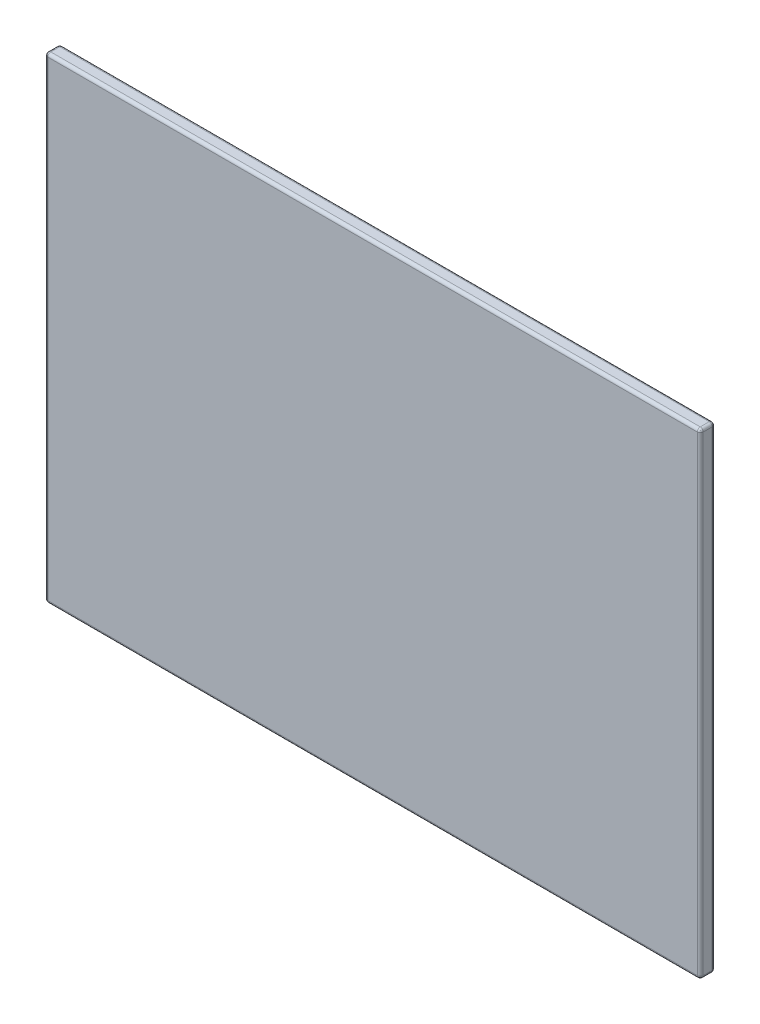
ISO-10303-21;
HEADER;
FILE_DESCRIPTION(('STEP AP214'),'2;1');
FILE_NAME('part.step','',(''),(''),'','','');
FILE_SCHEMA(('AUTOMOTIVE_DESIGN { 1 0 10303 214 1 1 1 1 }'));
ENDSEC;
DATA;
#1=APPLICATION_CONTEXT('core data for automotive mechanical design processes');
#2=APPLICATION_PROTOCOL_DEFINITION('international standard','automotive_design',2000,#1);
#3=PRODUCT_CONTEXT('',#1,'mechanical');
#4=PRODUCT('Part','Part','',(#3));
#5=PRODUCT_RELATED_PRODUCT_CATEGORY('part','',(#4));
#6=PRODUCT_DEFINITION_FORMATION('','',#4);
#7=PRODUCT_DEFINITION_CONTEXT('part definition',#1,'design');
#8=PRODUCT_DEFINITION('design','',#6,#7);
#9=PRODUCT_DEFINITION_SHAPE('','',#8);
#10=(LENGTH_UNIT() NAMED_UNIT(*) SI_UNIT(.MILLI.,.METRE.));
#11=(NAMED_UNIT(*) PLANE_ANGLE_UNIT() SI_UNIT($,.RADIAN.));
#12=(NAMED_UNIT(*) SI_UNIT($,.STERADIAN.) SOLID_ANGLE_UNIT());
#13=UNCERTAINTY_MEASURE_WITH_UNIT(LENGTH_MEASURE(1.E-05),#10,'distance_accuracy_value','');
#14=(GEOMETRIC_REPRESENTATION_CONTEXT(3) GLOBAL_UNCERTAINTY_ASSIGNED_CONTEXT((#13)) GLOBAL_UNIT_ASSIGNED_CONTEXT((#10,
#11,#12)) REPRESENTATION_CONTEXT('',''));
#15=CARTESIAN_POINT('',(0.,0.,0.));
#16=DIRECTION('',(0.,0.,1.));
#17=DIRECTION('',(1.,0.,0.));
#18=AXIS2_PLACEMENT_3D('',#15,#16,#17);
#19=CARTESIAN_POINT('',(-1.09,-0.79,0.04));
#20=DIRECTION('',(-0.577350269189626,-0.577350269189626,0.577350269189626));
#21=DIRECTION('',(-0.707106781186548,0.,-0.707106781186548));
#22=AXIS2_PLACEMENT_3D('',#19,#20,#21);
#23=SPHERICAL_SURFACE('',#22,0.01);
#24=CARTESIAN_POINT('',(-1.0957735026919,-0.795773502691896,0.0457735026918962));
#25=VERTEX_POINT('',#24);
#26=VERTEX_LOOP('',#25);
#27=FACE_BOUND('',#26,.T.);
#28=CARTESIAN_POINT('',(-1.09,-0.79,0.04));
#29=DIRECTION('',(0.,0.,1.));
#30=DIRECTION('',(1.,0.,0.));
#31=AXIS2_PLACEMENT_3D('',#28,#29,#30);
#32=CIRCLE('',#31,0.01);
#33=CARTESIAN_POINT('',(-1.09,-0.8,0.04));
#34=VERTEX_POINT('',#33);
#35=CARTESIAN_POINT('',(-1.1,-0.79,0.04));
#36=VERTEX_POINT('',#35);
#37=EDGE_CURVE('E112',#34,#36,#32,.F.);
#38=ORIENTED_EDGE('',*,*,#37,.F.);
#39=CARTESIAN_POINT('',(-1.09,-0.79,0.04));
#40=DIRECTION('',(1.,0.,0.));
#41=DIRECTION('',(0.,1.,0.));
#42=AXIS2_PLACEMENT_3D('',#39,#40,#41);
#43=CIRCLE('',#42,0.01);
#44=CARTESIAN_POINT('',(-1.09,-0.79,0.05));
#45=VERTEX_POINT('',#44);
#46=EDGE_CURVE('E123',#45,#34,#43,.T.);
#47=ORIENTED_EDGE('',*,*,#46,.F.);
#48=CARTESIAN_POINT('',(-1.09,-0.79,0.04));
#49=DIRECTION('',(0.,-1.,0.));
#50=DIRECTION('',(1.,0.,0.));
#51=AXIS2_PLACEMENT_3D('',#48,#49,#50);
#52=CIRCLE('',#51,0.01);
#53=EDGE_CURVE('E21',#36,#45,#52,.F.);
#54=ORIENTED_EDGE('',*,*,#53,.F.);
#55=EDGE_LOOP('',(#38,#47,#54));
#56=FACE_BOUND('',#55,.T.);
#57=ADVANCED_FACE('F17',(#27,#56),#23,.T.);
#58=CARTESIAN_POINT('',(1.09,-0.79,0.04));
#59=DIRECTION('',(0.577350269189626,-0.577350269189626,0.577350269189626));
#60=DIRECTION('',(0.,0.707106781186548,0.707106781186548));
#61=AXIS2_PLACEMENT_3D('',#58,#59,#60);
#62=SPHERICAL_SURFACE('',#61,0.01);
#63=CARTESIAN_POINT('',(1.0957735026919,-0.795773502691896,0.0457735026918962));
#64=VERTEX_POINT('',#63);
#65=VERTEX_LOOP('',#64);
#66=FACE_BOUND('',#65,.T.);
#67=CARTESIAN_POINT('',(1.09,-0.79,0.04));
#68=DIRECTION('',(0.,0.,1.));
#69=DIRECTION('',(1.,0.,0.));
#70=AXIS2_PLACEMENT_3D('',#67,#68,#69);
#71=CIRCLE('',#70,0.01);
#72=CARTESIAN_POINT('',(1.1,-0.79,0.04));
#73=VERTEX_POINT('',#72);
#74=CARTESIAN_POINT('',(1.09,-0.8,0.04));
#75=VERTEX_POINT('',#74);
#76=EDGE_CURVE('E224',#73,#75,#71,.F.);
#77=ORIENTED_EDGE('',*,*,#76,.F.);
#78=CARTESIAN_POINT('',(1.09,-0.79,0.04));
#79=DIRECTION('',(0.,1.,0.));
#80=DIRECTION('',(-1.,0.,0.));
#81=AXIS2_PLACEMENT_3D('',#78,#79,#80);
#82=CIRCLE('',#81,0.01);
#83=CARTESIAN_POINT('',(1.09,-0.79,0.05));
#84=VERTEX_POINT('',#83);
#85=EDGE_CURVE('E175',#84,#73,#82,.T.);
#86=ORIENTED_EDGE('',*,*,#85,.F.);
#87=CARTESIAN_POINT('',(1.09,-0.79,0.04));
#88=DIRECTION('',(1.,0.,0.));
#89=DIRECTION('',(0.,1.,0.));
#90=AXIS2_PLACEMENT_3D('',#87,#88,#89);
#91=CIRCLE('',#90,0.01);
#92=EDGE_CURVE('E180',#75,#84,#91,.F.);
#93=ORIENTED_EDGE('',*,*,#92,.F.);
#94=EDGE_LOOP('',(#77,#86,#93));
#95=FACE_BOUND('',#94,.T.);
#96=ADVANCED_FACE('F167',(#66,#95),#62,.T.);
#97=CARTESIAN_POINT('',(-1.09,0.79,0.04));
#98=DIRECTION('',(-0.577350269189626,0.577350269189626,0.577350269189626));
#99=DIRECTION('',(0.707106781186548,0.707106781186548,0.));
#100=AXIS2_PLACEMENT_3D('',#97,#98,#99);
#101=SPHERICAL_SURFACE('',#100,0.01);
#102=CARTESIAN_POINT('',(-1.0957735026919,0.795773502691896,0.0457735026918962));
#103=VERTEX_POINT('',#102);
#104=VERTEX_LOOP('',#103);
#105=FACE_BOUND('',#104,.T.);
#106=CARTESIAN_POINT('',(-1.09,0.79,0.04));
#107=DIRECTION('',(0.,0.,1.));
#108=DIRECTION('',(1.,0.,0.));
#109=AXIS2_PLACEMENT_3D('',#106,#107,#108);
#110=CIRCLE('',#109,0.01);
#111=CARTESIAN_POINT('',(-1.1,0.79,0.04));
#112=VERTEX_POINT('',#111);
#113=CARTESIAN_POINT('',(-1.09,0.8,0.04));
#114=VERTEX_POINT('',#113);
#115=EDGE_CURVE('E222',#112,#114,#110,.F.);
#116=ORIENTED_EDGE('',*,*,#115,.F.);
#117=CARTESIAN_POINT('',(-1.09,0.79,0.04));
#118=DIRECTION('',(0.,-1.,0.));
#119=DIRECTION('',(1.,0.,0.));
#120=AXIS2_PLACEMENT_3D('',#117,#118,#119);
#121=CIRCLE('',#120,0.01);
#122=CARTESIAN_POINT('',(-1.09,0.79,0.05));
#123=VERTEX_POINT('',#122);
#124=EDGE_CURVE('E141',#123,#112,#121,.T.);
#125=ORIENTED_EDGE('',*,*,#124,.F.);
#126=CARTESIAN_POINT('',(-1.09,0.79,0.04));
#127=DIRECTION('',(-1.,0.,0.));
#128=DIRECTION('',(0.,-1.,0.));
#129=AXIS2_PLACEMENT_3D('',#126,#127,#128);
#130=CIRCLE('',#129,0.01);
#131=EDGE_CURVE('E219',#114,#123,#130,.F.);
#132=ORIENTED_EDGE('',*,*,#131,.F.);
#133=EDGE_LOOP('',(#116,#125,#132));
#134=FACE_BOUND('',#133,.T.);
#135=ADVANCED_FACE('F164',(#105,#134),#101,.T.);
#136=CARTESIAN_POINT('',(0.,0.,0.05));
#137=DIRECTION('',(0.,0.,1.));
#138=DIRECTION('',(1.,0.,0.));
#139=AXIS2_PLACEMENT_3D('',#136,#137,#138);
#140=PLANE('',#139);
#141=DIRECTION('',(0.,1.,0.));
#142=VECTOR('',#141,1.);
#143=CARTESIAN_POINT('',(1.09,-0.4,0.05));
#144=LINE('',#143,#142);
#145=CARTESIAN_POINT('',(1.09,0.79,0.05));
#146=VERTEX_POINT('',#145);
#147=EDGE_CURVE('E173',#146,#84,#144,.F.);
#148=ORIENTED_EDGE('',*,*,#147,.F.);
#149=DIRECTION('',(-1.,0.,0.));
#150=VECTOR('',#149,1.);
#151=CARTESIAN_POINT('',(0.55,0.79,0.05));
#152=LINE('',#151,#150);
#153=EDGE_CURVE('E152',#123,#146,#152,.F.);
#154=ORIENTED_EDGE('',*,*,#153,.F.);
#155=DIRECTION('',(0.,-1.,0.));
#156=VECTOR('',#155,1.);
#157=CARTESIAN_POINT('',(-1.09,0.4,0.05));
#158=LINE('',#157,#156);
#159=EDGE_CURVE('E138',#45,#123,#158,.F.);
#160=ORIENTED_EDGE('',*,*,#159,.F.);
#161=DIRECTION('',(1.,0.,0.));
#162=VECTOR('',#161,1.);
#163=CARTESIAN_POINT('',(-0.55,-0.79,0.05));
#164=LINE('',#163,#162);
#165=EDGE_CURVE('E178',#84,#45,#164,.F.);
#166=ORIENTED_EDGE('',*,*,#165,.F.);
#167=EDGE_LOOP('',(#148,#154,#160,#166));
#168=FACE_BOUND('',#167,.T.);
#169=ADVANCED_FACE('F159',(#168),#140,.T.);
#170=CARTESIAN_POINT('',(1.09,0.79,0.04));
#171=DIRECTION('',(0.577350269189626,0.577350269189626,0.577350269189626));
#172=DIRECTION('',(0.707106781186548,-0.707106781186548,0.));
#173=AXIS2_PLACEMENT_3D('',#170,#171,#172);
#174=SPHERICAL_SURFACE('',#173,0.01);
#175=CARTESIAN_POINT('',(1.0957735026919,0.795773502691896,0.0457735026918962));
#176=VERTEX_POINT('',#175);
#177=VERTEX_LOOP('',#176);
#178=FACE_BOUND('',#177,.T.);
#179=CARTESIAN_POINT('',(1.09,0.79,0.04));
#180=DIRECTION('',(0.,0.,1.));
#181=DIRECTION('',(1.,0.,0.));
#182=AXIS2_PLACEMENT_3D('',#179,#180,#181);
#183=CIRCLE('',#182,0.01);
#184=CARTESIAN_POINT('',(1.09,0.8,0.04));
#185=VERTEX_POINT('',#184);
#186=CARTESIAN_POINT('',(1.1,0.79,0.04));
#187=VERTEX_POINT('',#186);
#188=EDGE_CURVE('E133',#185,#187,#183,.F.);
#189=ORIENTED_EDGE('',*,*,#188,.F.);
#190=CARTESIAN_POINT('',(1.09,0.79,0.04));
#191=DIRECTION('',(-1.,0.,0.));
#192=DIRECTION('',(0.,-1.,0.));
#193=AXIS2_PLACEMENT_3D('',#190,#191,#192);
#194=CIRCLE('',#193,0.01);
#195=EDGE_CURVE('E217',#146,#185,#194,.T.);
#196=ORIENTED_EDGE('',*,*,#195,.F.);
#197=CARTESIAN_POINT('',(1.09,0.79,0.04));
#198=DIRECTION('',(0.,1.,0.));
#199=DIRECTION('',(-1.,0.,0.));
#200=AXIS2_PLACEMENT_3D('',#197,#198,#199);
#201=CIRCLE('',#200,0.01);
#202=EDGE_CURVE('E122',#187,#146,#201,.F.);
#203=ORIENTED_EDGE('',*,*,#202,.F.);
#204=EDGE_LOOP('',(#189,#196,#203));
#205=FACE_BOUND('',#204,.T.);
#206=ADVANCED_FACE('F155',(#178,#205),#174,.T.);
#207=CARTESIAN_POINT('',(-1.09,0.4,0.04));
#208=DIRECTION('',(0.,-1.,0.));
#209=DIRECTION('',(1.,0.,0.));
#210=AXIS2_PLACEMENT_3D('',#207,#208,#209);
#211=CYLINDRICAL_SURFACE('',#210,0.01);
#212=ORIENTED_EDGE('',*,*,#124,.T.);
#213=DIRECTION('',(0.,-1.,0.));
#214=VECTOR('',#213,1.);
#215=CARTESIAN_POINT('',(-1.1,0.8,0.04));
#216=LINE('',#215,#214);
#217=EDGE_CURVE('E129',#36,#112,#216,.F.);
#218=ORIENTED_EDGE('',*,*,#217,.F.);
#219=ORIENTED_EDGE('',*,*,#53,.T.);
#220=ORIENTED_EDGE('',*,*,#159,.T.);
#221=EDGE_LOOP('',(#212,#218,#219,#220));
#222=FACE_BOUND('',#221,.T.);
#223=ADVANCED_FACE('F139',(#222),#211,.T.);
#224=CARTESIAN_POINT('',(-0.55,-0.79,0.04));
#225=DIRECTION('',(1.,0.,0.));
#226=DIRECTION('',(0.,1.,0.));
#227=AXIS2_PLACEMENT_3D('',#224,#225,#226);
#228=CYLINDRICAL_SURFACE('',#227,0.01);
#229=ORIENTED_EDGE('',*,*,#46,.T.);
#230=DIRECTION('',(1.,0.,0.));
#231=VECTOR('',#230,1.);
#232=CARTESIAN_POINT('',(-1.1,-0.8,0.04));
#233=LINE('',#232,#231);
#234=EDGE_CURVE('E148',#75,#34,#233,.F.);
#235=ORIENTED_EDGE('',*,*,#234,.F.);
#236=ORIENTED_EDGE('',*,*,#92,.T.);
#237=ORIENTED_EDGE('',*,*,#165,.T.);
#238=EDGE_LOOP('',(#229,#235,#236,#237));
#239=FACE_BOUND('',#238,.T.);
#240=ADVANCED_FACE('F233',(#239),#228,.T.);
#241=CARTESIAN_POINT('',(-1.09,-0.79,0.));
#242=DIRECTION('',(0.,0.,1.));
#243=DIRECTION('',(1.,0.,0.));
#244=AXIS2_PLACEMENT_3D('',#241,#242,#243);
#245=CYLINDRICAL_SURFACE('',#244,0.01);
#246=CARTESIAN_POINT('',(-1.09,-0.79,0.01));
#247=DIRECTION('',(0.,0.,1.));
#248=DIRECTION('',(1.,0.,0.));
#249=AXIS2_PLACEMENT_3D('',#246,#247,#248);
#250=CIRCLE('',#249,0.01);
#251=CARTESIAN_POINT('',(-1.09,-0.8,0.01));
#252=VERTEX_POINT('',#251);
#253=CARTESIAN_POINT('',(-1.1,-0.79,0.01));
#254=VERTEX_POINT('',#253);
#255=EDGE_CURVE('E144',#252,#254,#250,.F.);
#256=ORIENTED_EDGE('',*,*,#255,.F.);
#257=DIRECTION('',(0.,0.,1.));
#258=VECTOR('',#257,1.);
#259=CARTESIAN_POINT('',(-1.09,-0.8,0.));
#260=LINE('',#259,#258);
#261=EDGE_CURVE('E118',#34,#252,#260,.F.);
#262=ORIENTED_EDGE('',*,*,#261,.F.);
#263=ORIENTED_EDGE('',*,*,#37,.T.);
#264=DIRECTION('',(0.,0.,1.));
#265=VECTOR('',#264,1.);
#266=CARTESIAN_POINT('',(-1.1,-0.79,0.));
#267=LINE('',#266,#265);
#268=EDGE_CURVE('E116',#254,#36,#267,.T.);
#269=ORIENTED_EDGE('',*,*,#268,.F.);
#270=EDGE_LOOP('',(#256,#262,#263,#269));
#271=FACE_BOUND('',#270,.T.);
#272=ADVANCED_FACE('F115',(#271),#245,.T.);
#273=CARTESIAN_POINT('',(1.09,-0.4,0.04));
#274=DIRECTION('',(0.,1.,0.));
#275=DIRECTION('',(-1.,0.,0.));
#276=AXIS2_PLACEMENT_3D('',#273,#274,#275);
#277=CYLINDRICAL_SURFACE('',#276,0.01);
#278=ORIENTED_EDGE('',*,*,#85,.T.);
#279=DIRECTION('',(0.,1.,0.));
#280=VECTOR('',#279,1.);
#281=CARTESIAN_POINT('',(1.1,-0.8,0.04));
#282=LINE('',#281,#280);
#283=EDGE_CURVE('E318',#187,#73,#282,.F.);
#284=ORIENTED_EDGE('',*,*,#283,.F.);
#285=ORIENTED_EDGE('',*,*,#202,.T.);
#286=ORIENTED_EDGE('',*,*,#147,.T.);
#287=EDGE_LOOP('',(#278,#284,#285,#286));
#288=FACE_BOUND('',#287,.T.);
#289=ADVANCED_FACE('F244',(#288),#277,.T.);
#290=CARTESIAN_POINT('',(1.09,-0.79,0.));
#291=DIRECTION('',(0.,0.,1.));
#292=DIRECTION('',(1.,0.,0.));
#293=AXIS2_PLACEMENT_3D('',#290,#291,#292);
#294=CYLINDRICAL_SURFACE('',#293,0.01);
#295=CARTESIAN_POINT('',(1.09,-0.79,0.01));
#296=DIRECTION('',(0.,0.,1.));
#297=DIRECTION('',(1.,0.,0.));
#298=AXIS2_PLACEMENT_3D('',#295,#296,#297);
#299=CIRCLE('',#298,0.01);
#300=CARTESIAN_POINT('',(1.1,-0.79,0.01));
#301=VERTEX_POINT('',#300);
#302=CARTESIAN_POINT('',(1.09,-0.8,0.01));
#303=VERTEX_POINT('',#302);
#304=EDGE_CURVE('E211',#301,#303,#299,.F.);
#305=ORIENTED_EDGE('',*,*,#304,.F.);
#306=DIRECTION('',(0.,0.,1.));
#307=VECTOR('',#306,1.);
#308=CARTESIAN_POINT('',(1.1,-0.79,0.));
#309=LINE('',#308,#307);
#310=EDGE_CURVE('E210',#73,#301,#309,.F.);
#311=ORIENTED_EDGE('',*,*,#310,.F.);
#312=ORIENTED_EDGE('',*,*,#76,.T.);
#313=DIRECTION('',(0.,0.,1.));
#314=VECTOR('',#313,1.);
#315=CARTESIAN_POINT('',(1.09,-0.8,0.));
#316=LINE('',#315,#314);
#317=EDGE_CURVE('E215',#303,#75,#316,.T.);
#318=ORIENTED_EDGE('',*,*,#317,.F.);
#319=EDGE_LOOP('',(#305,#311,#312,#318));
#320=FACE_BOUND('',#319,.T.);
#321=ADVANCED_FACE('F352',(#320),#294,.T.);
#322=CARTESIAN_POINT('',(-1.09,0.79,0.));
#323=DIRECTION('',(0.,0.,1.));
#324=DIRECTION('',(1.,0.,0.));
#325=AXIS2_PLACEMENT_3D('',#322,#323,#324);
#326=CYLINDRICAL_SURFACE('',#325,0.01);
#327=CARTESIAN_POINT('',(-1.09,0.79,0.01));
#328=DIRECTION('',(0.,0.,1.));
#329=DIRECTION('',(1.,0.,0.));
#330=AXIS2_PLACEMENT_3D('',#327,#328,#329);
#331=CIRCLE('',#330,0.01);
#332=CARTESIAN_POINT('',(-1.1,0.79,0.01));
#333=VERTEX_POINT('',#332);
#334=CARTESIAN_POINT('',(-1.09,0.8,0.01));
#335=VERTEX_POINT('',#334);
#336=EDGE_CURVE('E205',#333,#335,#331,.F.);
#337=ORIENTED_EDGE('',*,*,#336,.F.);
#338=DIRECTION('',(0.,0.,1.));
#339=VECTOR('',#338,1.);
#340=CARTESIAN_POINT('',(-1.1,0.79,0.));
#341=LINE('',#340,#339);
#342=EDGE_CURVE('E142',#112,#333,#341,.F.);
#343=ORIENTED_EDGE('',*,*,#342,.F.);
#344=ORIENTED_EDGE('',*,*,#115,.T.);
#345=DIRECTION('',(0.,0.,1.));
#346=VECTOR('',#345,1.);
#347=CARTESIAN_POINT('',(-1.09,0.8,0.));
#348=LINE('',#347,#346);
#349=EDGE_CURVE('E207',#335,#114,#348,.T.);
#350=ORIENTED_EDGE('',*,*,#349,.F.);
#351=EDGE_LOOP('',(#337,#343,#344,#350));
#352=FACE_BOUND('',#351,.T.);
#353=ADVANCED_FACE('F374',(#352),#326,.T.);
#354=CARTESIAN_POINT('',(0.55,0.79,0.04));
#355=DIRECTION('',(-1.,0.,0.));
#356=DIRECTION('',(0.,-1.,0.));
#357=AXIS2_PLACEMENT_3D('',#354,#355,#356);
#358=CYLINDRICAL_SURFACE('',#357,0.01);
#359=ORIENTED_EDGE('',*,*,#195,.T.);
#360=DIRECTION('',(-1.,0.,0.));
#361=VECTOR('',#360,1.);
#362=CARTESIAN_POINT('',(1.1,0.8,0.04));
#363=LINE('',#362,#361);
#364=EDGE_CURVE('E310',#114,#185,#363,.F.);
#365=ORIENTED_EDGE('',*,*,#364,.F.);
#366=ORIENTED_EDGE('',*,*,#131,.T.);
#367=ORIENTED_EDGE('',*,*,#153,.T.);
#368=EDGE_LOOP('',(#359,#365,#366,#367));
#369=FACE_BOUND('',#368,.T.);
#370=ADVANCED_FACE('F421',(#369),#358,.T.);
#371=CARTESIAN_POINT('',(1.09,0.79,0.));
#372=DIRECTION('',(0.,0.,1.));
#373=DIRECTION('',(1.,0.,0.));
#374=AXIS2_PLACEMENT_3D('',#371,#372,#373);
#375=CYLINDRICAL_SURFACE('',#374,0.01);
#376=CARTESIAN_POINT('',(1.09,0.79,0.01));
#377=DIRECTION('',(0.,0.,1.));
#378=DIRECTION('',(1.,0.,0.));
#379=AXIS2_PLACEMENT_3D('',#376,#377,#378);
#380=CIRCLE('',#379,0.01);
#381=CARTESIAN_POINT('',(1.09,0.8,0.01));
#382=VERTEX_POINT('',#381);
#383=CARTESIAN_POINT('',(1.1,0.79,0.01));
#384=VERTEX_POINT('',#383);
#385=EDGE_CURVE('E208',#382,#384,#380,.F.);
#386=ORIENTED_EDGE('',*,*,#385,.F.);
#387=DIRECTION('',(0.,0.,1.));
#388=VECTOR('',#387,1.);
#389=CARTESIAN_POINT('',(1.09,0.8,0.));
#390=LINE('',#389,#388);
#391=EDGE_CURVE('E204',#185,#382,#390,.F.);
#392=ORIENTED_EDGE('',*,*,#391,.F.);
#393=ORIENTED_EDGE('',*,*,#188,.T.);
#394=DIRECTION('',(0.,0.,1.));
#395=VECTOR('',#394,1.);
#396=CARTESIAN_POINT('',(1.1,0.79,0.));
#397=LINE('',#396,#395);
#398=EDGE_CURVE('E213',#384,#187,#397,.T.);
#399=ORIENTED_EDGE('',*,*,#398,.F.);
#400=EDGE_LOOP('',(#386,#392,#393,#399));
#401=FACE_BOUND('',#400,.T.);
#402=ADVANCED_FACE('F382',(#401),#375,.T.);
#403=CARTESIAN_POINT('',(-1.1,0.8,0.));
#404=DIRECTION('',(-1.,0.,0.));
#405=DIRECTION('',(0.,-1.,0.));
#406=AXIS2_PLACEMENT_3D('',#403,#404,#405);
#407=PLANE('',#406);
#408=ORIENTED_EDGE('',*,*,#342,.T.);
#409=DIRECTION('',(0.,1.,0.));
#410=VECTOR('',#409,1.);
#411=CARTESIAN_POINT('',(-1.1,0.4,0.01));
#412=LINE('',#411,#410);
#413=EDGE_CURVE('E132',#254,#333,#412,.T.);
#414=ORIENTED_EDGE('',*,*,#413,.F.);
#415=ORIENTED_EDGE('',*,*,#268,.T.);
#416=ORIENTED_EDGE('',*,*,#217,.T.);
#417=EDGE_LOOP('',(#408,#414,#415,#416));
#418=FACE_BOUND('',#417,.T.);
#419=ADVANCED_FACE('F127',(#418),#407,.T.);
#420=CARTESIAN_POINT('',(-1.09,-0.79,0.01));
#421=DIRECTION('',(-0.577350269189626,-0.577350269189626,-0.577350269189626));
#422=DIRECTION('',(0.,-0.707106781186548,0.707106781186548));
#423=AXIS2_PLACEMENT_3D('',#420,#421,#422);
#424=SPHERICAL_SURFACE('',#423,0.01);
#425=CARTESIAN_POINT('',(-1.0957735026919,-0.795773502691896,0.00422649730810376));
#426=VERTEX_POINT('',#425);
#427=VERTEX_LOOP('',#426);
#428=FACE_BOUND('',#427,.T.);
#429=CARTESIAN_POINT('',(-1.09,-0.79,0.01));
#430=DIRECTION('',(-1.,0.,0.));
#431=DIRECTION('',(0.,-1.,0.));
#432=AXIS2_PLACEMENT_3D('',#429,#430,#431);
#433=CIRCLE('',#432,0.01);
#434=CARTESIAN_POINT('',(-1.09,-0.79,0.));
#435=VERTEX_POINT('',#434);
#436=EDGE_CURVE('E197',#252,#435,#433,.F.);
#437=ORIENTED_EDGE('',*,*,#436,.F.);
#438=ORIENTED_EDGE('',*,*,#255,.T.);
#439=CARTESIAN_POINT('',(-1.09,-0.79,0.01));
#440=DIRECTION('',(0.,1.,0.));
#441=DIRECTION('',(-1.,0.,0.));
#442=AXIS2_PLACEMENT_3D('',#439,#440,#441);
#443=CIRCLE('',#442,0.01);
#444=EDGE_CURVE('E199',#435,#254,#443,.T.);
#445=ORIENTED_EDGE('',*,*,#444,.F.);
#446=EDGE_LOOP('',(#437,#438,#445));
#447=FACE_BOUND('',#446,.T.);
#448=ADVANCED_FACE('F333',(#428,#447),#424,.T.);
#449=CARTESIAN_POINT('',(-1.1,-0.8,0.));
#450=DIRECTION('',(0.,-1.,0.));
#451=DIRECTION('',(1.,0.,0.));
#452=AXIS2_PLACEMENT_3D('',#449,#450,#451);
#453=PLANE('',#452);
#454=ORIENTED_EDGE('',*,*,#234,.T.);
#455=ORIENTED_EDGE('',*,*,#261,.T.);
#456=DIRECTION('',(-1.,0.,0.));
#457=VECTOR('',#456,1.);
#458=CARTESIAN_POINT('',(-0.55,-0.8,0.01));
#459=LINE('',#458,#457);
#460=EDGE_CURVE('E193',#303,#252,#459,.T.);
#461=ORIENTED_EDGE('',*,*,#460,.F.);
#462=ORIENTED_EDGE('',*,*,#317,.T.);
#463=EDGE_LOOP('',(#454,#455,#461,#462));
#464=FACE_BOUND('',#463,.T.);
#465=ADVANCED_FACE('F329',(#464),#453,.T.);
#466=CARTESIAN_POINT('',(1.09,-0.79,0.01));
#467=DIRECTION('',(0.577350269189626,-0.577350269189626,-0.577350269189626));
#468=DIRECTION('',(0.,-0.707106781186548,0.707106781186548));
#469=AXIS2_PLACEMENT_3D('',#466,#467,#468);
#470=SPHERICAL_SURFACE('',#469,0.01);
#471=CARTESIAN_POINT('',(1.0957735026919,-0.795773502691896,0.00422649730810376));
#472=VERTEX_POINT('',#471);
#473=VERTEX_LOOP('',#472);
#474=FACE_BOUND('',#473,.T.);
#475=CARTESIAN_POINT('',(1.09,-0.79,0.01));
#476=DIRECTION('',(0.,-1.,0.));
#477=DIRECTION('',(1.,0.,0.));
#478=AXIS2_PLACEMENT_3D('',#475,#476,#477);
#479=CIRCLE('',#478,0.01);
#480=CARTESIAN_POINT('',(1.09,-0.79,0.));
#481=VERTEX_POINT('',#480);
#482=EDGE_CURVE('E191',#301,#481,#479,.F.);
#483=ORIENTED_EDGE('',*,*,#482,.F.);
#484=ORIENTED_EDGE('',*,*,#304,.T.);
#485=CARTESIAN_POINT('',(1.09,-0.79,0.01));
#486=DIRECTION('',(-1.,0.,0.));
#487=DIRECTION('',(0.,-1.,0.));
#488=AXIS2_PLACEMENT_3D('',#485,#486,#487);
#489=CIRCLE('',#488,0.01);
#490=EDGE_CURVE('E194',#481,#303,#489,.T.);
#491=ORIENTED_EDGE('',*,*,#490,.F.);
#492=EDGE_LOOP('',(#483,#484,#491));
#493=FACE_BOUND('',#492,.T.);
#494=ADVANCED_FACE('F325',(#474,#493),#470,.T.);
#495=CARTESIAN_POINT('',(1.1,-0.8,0.));
#496=DIRECTION('',(1.,0.,0.));
#497=DIRECTION('',(0.,1.,0.));
#498=AXIS2_PLACEMENT_3D('',#495,#496,#497);
#499=PLANE('',#498);
#500=ORIENTED_EDGE('',*,*,#310,.T.);
#501=DIRECTION('',(0.,-1.,0.));
#502=VECTOR('',#501,1.);
#503=CARTESIAN_POINT('',(1.1,-0.4,0.01));
#504=LINE('',#503,#502);
#505=EDGE_CURVE('E187',#384,#301,#504,.T.);
#506=ORIENTED_EDGE('',*,*,#505,.F.);
#507=ORIENTED_EDGE('',*,*,#398,.T.);
#508=ORIENTED_EDGE('',*,*,#283,.T.);
#509=EDGE_LOOP('',(#500,#506,#507,#508));
#510=FACE_BOUND('',#509,.T.);
#511=ADVANCED_FACE('F328',(#510),#499,.T.);
#512=CARTESIAN_POINT('',(1.09,0.79,0.01));
#513=DIRECTION('',(0.577350269189626,0.577350269189626,-0.577350269189626));
#514=DIRECTION('',(0.,-0.707106781186548,-0.707106781186548));
#515=AXIS2_PLACEMENT_3D('',#512,#513,#514);
#516=SPHERICAL_SURFACE('',#515,0.01);
#517=CARTESIAN_POINT('',(1.0957735026919,0.795773502691896,0.00422649730810376));
#518=VERTEX_POINT('',#517);
#519=VERTEX_LOOP('',#518);
#520=FACE_BOUND('',#519,.T.);
#521=CARTESIAN_POINT('',(1.09,0.79,0.01));
#522=DIRECTION('',(1.,0.,0.));
#523=DIRECTION('',(0.,1.,0.));
#524=AXIS2_PLACEMENT_3D('',#521,#522,#523);
#525=CIRCLE('',#524,0.01);
#526=CARTESIAN_POINT('',(1.09,0.79,0.));
#527=VERTEX_POINT('',#526);
#528=EDGE_CURVE('E35',#382,#527,#525,.F.);
#529=ORIENTED_EDGE('',*,*,#528,.F.);
#530=ORIENTED_EDGE('',*,*,#385,.T.);
#531=CARTESIAN_POINT('',(1.09,0.79,0.01));
#532=DIRECTION('',(0.,-1.,0.));
#533=DIRECTION('',(1.,0.,0.));
#534=AXIS2_PLACEMENT_3D('',#531,#532,#533);
#535=CIRCLE('',#534,0.01);
#536=EDGE_CURVE('E188',#527,#384,#535,.T.);
#537=ORIENTED_EDGE('',*,*,#536,.F.);
#538=EDGE_LOOP('',(#529,#530,#537));
#539=FACE_BOUND('',#538,.T.);
#540=ADVANCED_FACE('F298',(#520,#539),#516,.T.);
#541=CARTESIAN_POINT('',(-1.09,0.79,0.01));
#542=DIRECTION('',(-0.577350269189626,0.577350269189626,-0.577350269189626));
#543=DIRECTION('',(0.,-0.707106781186548,-0.707106781186548));
#544=AXIS2_PLACEMENT_3D('',#541,#542,#543);
#545=SPHERICAL_SURFACE('',#544,0.01);
#546=CARTESIAN_POINT('',(-1.0957735026919,0.795773502691896,0.00422649730810376));
#547=VERTEX_POINT('',#546);
#548=VERTEX_LOOP('',#547);
#549=FACE_BOUND('',#548,.T.);
#550=CARTESIAN_POINT('',(-1.09,0.79,0.01));
#551=DIRECTION('',(1.,0.,0.));
#552=DIRECTION('',(0.,1.,0.));
#553=AXIS2_PLACEMENT_3D('',#550,#551,#552);
#554=CIRCLE('',#553,0.01);
#555=CARTESIAN_POINT('',(-1.09,0.79,0.));
#556=VERTEX_POINT('',#555);
#557=EDGE_CURVE('E182',#556,#335,#554,.T.);
#558=ORIENTED_EDGE('',*,*,#557,.F.);
#559=CARTESIAN_POINT('',(-1.09,0.79,0.01));
#560=DIRECTION('',(0.,1.,0.));
#561=DIRECTION('',(-1.,0.,0.));
#562=AXIS2_PLACEMENT_3D('',#559,#560,#561);
#563=CIRCLE('',#562,0.01);
#564=EDGE_CURVE('E202',#333,#556,#563,.F.);
#565=ORIENTED_EDGE('',*,*,#564,.F.);
#566=ORIENTED_EDGE('',*,*,#336,.T.);
#567=EDGE_LOOP('',(#558,#565,#566));
#568=FACE_BOUND('',#567,.T.);
#569=ADVANCED_FACE('F293',(#549,#568),#545,.T.);
#570=CARTESIAN_POINT('',(1.1,0.8,0.));
#571=DIRECTION('',(0.,1.,0.));
#572=DIRECTION('',(-1.,0.,0.));
#573=AXIS2_PLACEMENT_3D('',#570,#571,#572);
#574=PLANE('',#573);
#575=ORIENTED_EDGE('',*,*,#364,.T.);
#576=ORIENTED_EDGE('',*,*,#391,.T.);
#577=DIRECTION('',(1.,0.,0.));
#578=VECTOR('',#577,1.);
#579=CARTESIAN_POINT('',(0.55,0.8,0.01));
#580=LINE('',#579,#578);
#581=EDGE_CURVE('E185',#335,#382,#580,.T.);
#582=ORIENTED_EDGE('',*,*,#581,.F.);
#583=ORIENTED_EDGE('',*,*,#349,.T.);
#584=EDGE_LOOP('',(#575,#576,#582,#583));
#585=FACE_BOUND('',#584,.T.);
#586=ADVANCED_FACE('F289',(#585),#574,.T.);
#587=CARTESIAN_POINT('',(-1.09,0.4,0.01));
#588=DIRECTION('',(0.,1.,0.));
#589=DIRECTION('',(-1.,0.,0.));
#590=AXIS2_PLACEMENT_3D('',#587,#588,#589);
#591=CYLINDRICAL_SURFACE('',#590,0.01);
#592=ORIENTED_EDGE('',*,*,#444,.T.);
#593=ORIENTED_EDGE('',*,*,#413,.T.);
#594=ORIENTED_EDGE('',*,*,#564,.T.);
#595=DIRECTION('',(0.,1.,0.));
#596=VECTOR('',#595,1.);
#597=CARTESIAN_POINT('',(-1.09,0.,0.));
#598=LINE('',#597,#596);
#599=EDGE_CURVE('E304',#556,#435,#598,.F.);
#600=ORIENTED_EDGE('',*,*,#599,.T.);
#601=EDGE_LOOP('',(#592,#593,#594,#600));
#602=FACE_BOUND('',#601,.T.);
#603=ADVANCED_FACE('F285',(#602),#591,.T.);
#604=CARTESIAN_POINT('',(-0.55,-0.79,0.01));
#605=DIRECTION('',(-1.,0.,0.));
#606=DIRECTION('',(0.,-1.,0.));
#607=AXIS2_PLACEMENT_3D('',#604,#605,#606);
#608=CYLINDRICAL_SURFACE('',#607,0.01);
#609=ORIENTED_EDGE('',*,*,#490,.T.);
#610=ORIENTED_EDGE('',*,*,#460,.T.);
#611=ORIENTED_EDGE('',*,*,#436,.T.);
#612=DIRECTION('',(1.,0.,0.));
#613=VECTOR('',#612,1.);
#614=CARTESIAN_POINT('',(0.,-0.79,0.));
#615=LINE('',#614,#613);
#616=EDGE_CURVE('E306',#435,#481,#615,.T.);
#617=ORIENTED_EDGE('',*,*,#616,.T.);
#618=EDGE_LOOP('',(#609,#610,#611,#617));
#619=FACE_BOUND('',#618,.T.);
#620=ADVANCED_FACE('F281',(#619),#608,.T.);
#621=CARTESIAN_POINT('',(1.09,-0.4,0.01));
#622=DIRECTION('',(0.,-1.,0.));
#623=DIRECTION('',(1.,0.,0.));
#624=AXIS2_PLACEMENT_3D('',#621,#622,#623);
#625=CYLINDRICAL_SURFACE('',#624,0.01);
#626=ORIENTED_EDGE('',*,*,#536,.T.);
#627=ORIENTED_EDGE('',*,*,#505,.T.);
#628=ORIENTED_EDGE('',*,*,#482,.T.);
#629=DIRECTION('',(0.,1.,0.));
#630=VECTOR('',#629,1.);
#631=CARTESIAN_POINT('',(1.09,0.,0.));
#632=LINE('',#631,#630);
#633=EDGE_CURVE('E27',#481,#527,#632,.T.);
#634=ORIENTED_EDGE('',*,*,#633,.T.);
#635=EDGE_LOOP('',(#626,#627,#628,#634));
#636=FACE_BOUND('',#635,.T.);
#637=ADVANCED_FACE('F275',(#636),#625,.T.);
#638=CARTESIAN_POINT('',(0.55,0.79,0.01));
#639=DIRECTION('',(1.,0.,0.));
#640=DIRECTION('',(0.,1.,0.));
#641=AXIS2_PLACEMENT_3D('',#638,#639,#640);
#642=CYLINDRICAL_SURFACE('',#641,0.01);
#643=ORIENTED_EDGE('',*,*,#557,.T.);
#644=ORIENTED_EDGE('',*,*,#581,.T.);
#645=ORIENTED_EDGE('',*,*,#528,.T.);
#646=DIRECTION('',(1.,0.,0.));
#647=VECTOR('',#646,1.);
#648=CARTESIAN_POINT('',(0.,0.79,0.));
#649=LINE('',#648,#647);
#650=EDGE_CURVE('E11',#527,#556,#649,.F.);
#651=ORIENTED_EDGE('',*,*,#650,.T.);
#652=EDGE_LOOP('',(#643,#644,#645,#651));
#653=FACE_BOUND('',#652,.T.);
#654=ADVANCED_FACE('F269',(#653),#642,.T.);
#655=CARTESIAN_POINT('',(0.,0.,0.));
#656=DIRECTION('',(0.,0.,1.));
#657=DIRECTION('',(1.,0.,0.));
#658=AXIS2_PLACEMENT_3D('',#655,#656,#657);
#659=PLANE('',#658);
#660=ORIENTED_EDGE('',*,*,#633,.F.);
#661=ORIENTED_EDGE('',*,*,#616,.F.);
#662=ORIENTED_EDGE('',*,*,#599,.F.);
#663=ORIENTED_EDGE('',*,*,#650,.F.);
#664=EDGE_LOOP('',(#660,#661,#662,#663));
#665=FACE_BOUND('',#664,.T.);
#666=ADVANCED_FACE('F267',(#665),#659,.F.);
#667=CLOSED_SHELL('',(#57,#96,#135,#169,#206,#223,#240,#272,#289,#321,#353,#370,#402,#419,#448,
#465,#494,#511,#540,#569,#586,#603,#620,#637,#654,#666));
#668=MANIFOLD_SOLID_BREP('B1',#667);
#669=ADVANCED_BREP_SHAPE_REPRESENTATION('',(#18,#668),#14);
#670=SHAPE_DEFINITION_REPRESENTATION(#9,#669);
ENDSEC;
END-ISO-10303-21;
